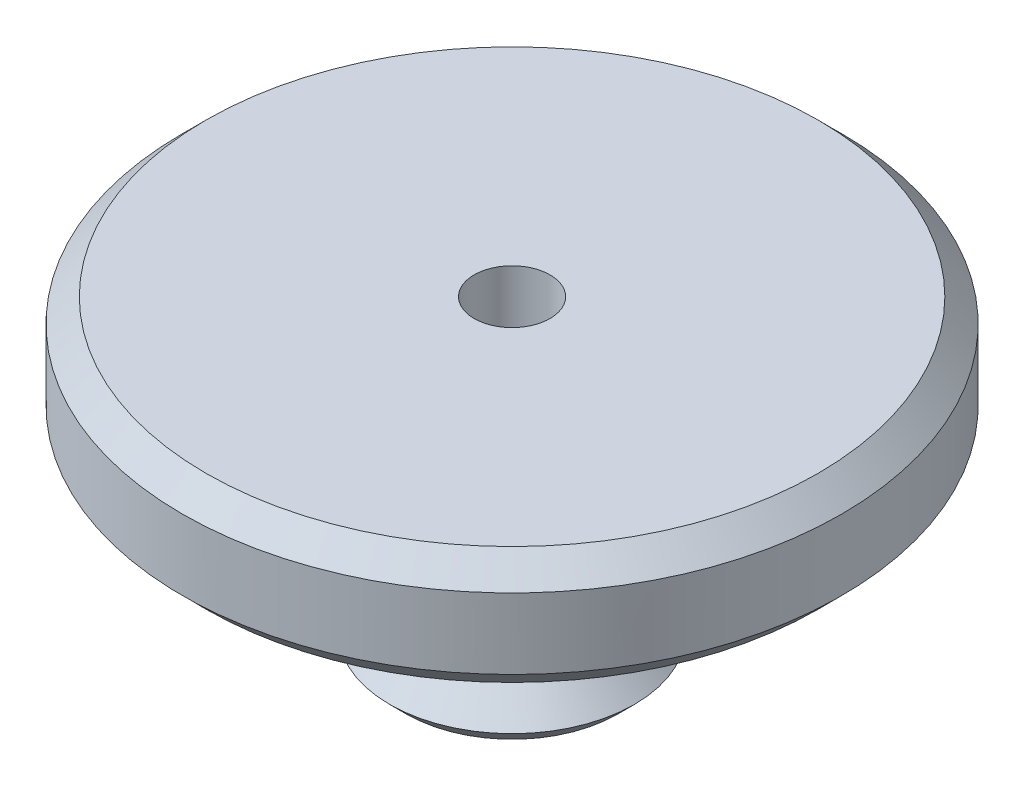
ISO-10303-21;
HEADER;
FILE_DESCRIPTION(('STEP AP214'),'2;1');
FILE_NAME('part.step','',(''),(''),'','','');
FILE_SCHEMA(('AUTOMOTIVE_DESIGN { 1 0 10303 214 1 1 1 1 }'));
ENDSEC;
DATA;
#1=APPLICATION_CONTEXT('core data for automotive mechanical design processes');
#2=APPLICATION_PROTOCOL_DEFINITION('international standard','automotive_design',2000,#1);
#3=PRODUCT_CONTEXT('',#1,'mechanical');
#4=PRODUCT('Part','Part','',(#3));
#5=PRODUCT_RELATED_PRODUCT_CATEGORY('part','',(#4));
#6=PRODUCT_DEFINITION_FORMATION('','',#4);
#7=PRODUCT_DEFINITION_CONTEXT('part definition',#1,'design');
#8=PRODUCT_DEFINITION('design','',#6,#7);
#9=PRODUCT_DEFINITION_SHAPE('','',#8);
#10=(LENGTH_UNIT() NAMED_UNIT(*) SI_UNIT(.MILLI.,.METRE.));
#11=(NAMED_UNIT(*) PLANE_ANGLE_UNIT() SI_UNIT($,.RADIAN.));
#12=(NAMED_UNIT(*) SI_UNIT($,.STERADIAN.) SOLID_ANGLE_UNIT());
#13=UNCERTAINTY_MEASURE_WITH_UNIT(LENGTH_MEASURE(1.E-05),#10,'distance_accuracy_value','');
#14=(GEOMETRIC_REPRESENTATION_CONTEXT(3) GLOBAL_UNCERTAINTY_ASSIGNED_CONTEXT((#13)) GLOBAL_UNIT_ASSIGNED_CONTEXT((#10,
#11,#12)) REPRESENTATION_CONTEXT('',''));
#15=CARTESIAN_POINT('',(0.,0.,0.));
#16=DIRECTION('',(0.,0.,1.));
#17=DIRECTION('',(1.,0.,0.));
#18=AXIS2_PLACEMENT_3D('',#15,#16,#17);
#19=CARTESIAN_POINT('',(0.,0.,0.));
#20=DIRECTION('',(0.,1.,0.));
#21=DIRECTION('',(0.,0.,1.));
#22=AXIS2_PLACEMENT_3D('',#19,#20,#21);
#23=PLANE('',#22);
#24=CARTESIAN_POINT('',(0.,0.,0.));
#25=DIRECTION('',(0.,1.,0.));
#26=DIRECTION('',(0.,0.,1.));
#27=AXIS2_PLACEMENT_3D('',#24,#25,#26);
#28=CIRCLE('',#27,13.);
#29=CARTESIAN_POINT('',(0.,0.,13.));
#30=VERTEX_POINT('',#29);
#31=EDGE_CURVE('E12',#30,#30,#28,.T.);
#32=ORIENTED_EDGE('',*,*,#31,.T.);
#33=EDGE_LOOP('',(#32));
#34=FACE_BOUND('',#33,.T.);
#35=CARTESIAN_POINT('',(0.,0.,0.));
#36=DIRECTION('',(0.,1.,0.));
#37=DIRECTION('',(0.,0.,1.));
#38=AXIS2_PLACEMENT_3D('',#35,#36,#37);
#39=CIRCLE('',#38,1.61);
#40=CARTESIAN_POINT('',(0.,0.,1.61));
#41=VERTEX_POINT('',#40);
#42=EDGE_CURVE('E98',#41,#41,#39,.T.);
#43=ORIENTED_EDGE('',*,*,#42,.F.);
#44=EDGE_LOOP('',(#43));
#45=FACE_BOUND('',#44,.T.);
#46=ADVANCED_FACE('F48',(#34,#45),#23,.T.);
#47=CARTESIAN_POINT('',(0.,-10.,0.));
#48=DIRECTION('',(0.,-1.,0.));
#49=DIRECTION('',(0.,0.,-1.));
#50=AXIS2_PLACEMENT_3D('',#47,#48,#49);
#51=CYLINDRICAL_SURFACE('',#50,14.);
#52=CARTESIAN_POINT('',(0.,-4.00000000000001,0.));
#53=DIRECTION('',(0.,-1.,0.));
#54=DIRECTION('',(0.,0.,-1.));
#55=AXIS2_PLACEMENT_3D('',#52,#53,#54);
#56=CIRCLE('',#55,14.);
#57=CARTESIAN_POINT('',(0.,-4.00000000000001,-14.));
#58=VERTEX_POINT('',#57);
#59=EDGE_CURVE('E55',#58,#58,#56,.F.);
#60=ORIENTED_EDGE('',*,*,#59,.T.);
#61=EDGE_LOOP('',(#60));
#62=FACE_BOUND('',#61,.T.);
#63=CARTESIAN_POINT('',(0.,-0.999999999999994,0.));
#64=DIRECTION('',(0.,1.,0.));
#65=DIRECTION('',(0.,0.,1.));
#66=AXIS2_PLACEMENT_3D('',#63,#64,#65);
#67=CIRCLE('',#66,14.);
#68=CARTESIAN_POINT('',(0.,-0.999999999999994,14.));
#69=VERTEX_POINT('',#68);
#70=EDGE_CURVE('E59',#69,#69,#67,.F.);
#71=ORIENTED_EDGE('',*,*,#70,.T.);
#72=EDGE_LOOP('',(#71));
#73=FACE_BOUND('',#72,.T.);
#74=ADVANCED_FACE('F105',(#62,#73),#51,.T.);
#75=CARTESIAN_POINT('',(14.,-5.,0.));
#76=DIRECTION('',(0.,-1.,0.));
#77=DIRECTION('',(0.,0.,-1.));
#78=AXIS2_PLACEMENT_3D('',#75,#76,#77);
#79=PLANE('',#78);
#80=CARTESIAN_POINT('',(0.,-5.,0.));
#81=DIRECTION('',(0.,-1.,0.));
#82=DIRECTION('',(0.,0.,-1.));
#83=AXIS2_PLACEMENT_3D('',#80,#81,#82);
#84=CIRCLE('',#83,13.);
#85=CARTESIAN_POINT('',(0.,-5.,-13.));
#86=VERTEX_POINT('',#85);
#87=EDGE_CURVE('E63',#86,#86,#84,.T.);
#88=ORIENTED_EDGE('',*,*,#87,.T.);
#89=EDGE_LOOP('',(#88));
#90=FACE_BOUND('',#89,.T.);
#91=CARTESIAN_POINT('',(0.,-5.,0.));
#92=DIRECTION('',(0.,-1.,0.));
#93=DIRECTION('',(0.,0.,-1.));
#94=AXIS2_PLACEMENT_3D('',#91,#92,#93);
#95=CIRCLE('',#94,5.);
#96=CARTESIAN_POINT('',(0.,-5.,-5.00000000000001));
#97=VERTEX_POINT('',#96);
#98=EDGE_CURVE('E74',#97,#97,#95,.T.);
#99=ORIENTED_EDGE('',*,*,#98,.F.);
#100=EDGE_LOOP('',(#99));
#101=FACE_BOUND('',#100,.T.);
#102=ADVANCED_FACE('F110',(#90,#101),#79,.T.);
#103=CARTESIAN_POINT('',(0.,-10.,0.));
#104=DIRECTION('',(0.,-1.,0.));
#105=DIRECTION('',(0.,0.,-1.));
#106=AXIS2_PLACEMENT_3D('',#103,#104,#105);
#107=CYLINDRICAL_SURFACE('',#106,5.);
#108=ORIENTED_EDGE('',*,*,#98,.T.);
#109=EDGE_LOOP('',(#108));
#110=FACE_BOUND('',#109,.T.);
#111=CARTESIAN_POINT('',(0.,-10.,0.));
#112=DIRECTION('',(0.,-1.,0.));
#113=DIRECTION('',(0.,0.,-1.));
#114=AXIS2_PLACEMENT_3D('',#111,#112,#113);
#115=CIRCLE('',#114,5.);
#116=CARTESIAN_POINT('',(0.,-10.,-5.00000000000001));
#117=VERTEX_POINT('',#116);
#118=EDGE_CURVE('E77',#117,#117,#115,.T.);
#119=ORIENTED_EDGE('',*,*,#118,.F.);
#120=EDGE_LOOP('',(#119));
#121=FACE_BOUND('',#120,.T.);
#122=ADVANCED_FACE('F129',(#110,#121),#107,.T.);
#123=CARTESIAN_POINT('',(5.00000000000001,-10.,0.));
#124=DIRECTION('',(0.,-1.,0.));
#125=DIRECTION('',(0.,0.,-1.));
#126=AXIS2_PLACEMENT_3D('',#123,#124,#125);
#127=PLANE('',#126);
#128=ORIENTED_EDGE('',*,*,#118,.T.);
#129=EDGE_LOOP('',(#128));
#130=FACE_BOUND('',#129,.T.);
#131=CARTESIAN_POINT('',(0.,-10.,0.));
#132=DIRECTION('',(0.,-1.,0.));
#133=DIRECTION('',(0.,0.,-1.));
#134=AXIS2_PLACEMENT_3D('',#131,#132,#133);
#135=CIRCLE('',#134,4.);
#136=CARTESIAN_POINT('',(0.,-10.,-4.00000000000001));
#137=VERTEX_POINT('',#136);
#138=EDGE_CURVE('E80',#137,#137,#135,.T.);
#139=ORIENTED_EDGE('',*,*,#138,.F.);
#140=EDGE_LOOP('',(#139));
#141=FACE_BOUND('',#140,.T.);
#142=ADVANCED_FACE('F134',(#130,#141),#127,.T.);
#143=CARTESIAN_POINT('',(0.,-10.,0.));
#144=DIRECTION('',(0.,-1.,0.));
#145=DIRECTION('',(0.,0.,-1.));
#146=AXIS2_PLACEMENT_3D('',#143,#144,#145);
#147=CYLINDRICAL_SURFACE('',#146,4.);
#148=ORIENTED_EDGE('',*,*,#138,.T.);
#149=EDGE_LOOP('',(#148));
#150=FACE_BOUND('',#149,.T.);
#151=CARTESIAN_POINT('',(0.,-11.2,0.));
#152=DIRECTION('',(0.,-1.,0.));
#153=DIRECTION('',(0.,0.,-1.));
#154=AXIS2_PLACEMENT_3D('',#151,#152,#153);
#155=CIRCLE('',#154,4.);
#156=CARTESIAN_POINT('',(0.,-11.2,-4.00000000000001));
#157=VERTEX_POINT('',#156);
#158=EDGE_CURVE('E83',#157,#157,#155,.T.);
#159=ORIENTED_EDGE('',*,*,#158,.F.);
#160=EDGE_LOOP('',(#159));
#161=FACE_BOUND('',#160,.T.);
#162=ADVANCED_FACE('F140',(#150,#161),#147,.T.);
#163=CARTESIAN_POINT('',(0.,-12.4,0.));
#164=DIRECTION('',(0.,-1.,0.));
#165=DIRECTION('',(0.,0.,-1.));
#166=AXIS2_PLACEMENT_3D('',#163,#164,#165);
#167=CONICAL_SURFACE('',#166,5.20000000000001,0.785398163397451);
#168=ORIENTED_EDGE('',*,*,#158,.T.);
#169=EDGE_LOOP('',(#168));
#170=FACE_BOUND('',#169,.T.);
#171=CARTESIAN_POINT('',(0.,-12.4,0.));
#172=DIRECTION('',(0.,-1.,0.));
#173=DIRECTION('',(0.,0.,-1.));
#174=AXIS2_PLACEMENT_3D('',#171,#172,#173);
#175=CIRCLE('',#174,5.20000000000001);
#176=CARTESIAN_POINT('',(0.,-12.4,-5.20000000000002));
#177=VERTEX_POINT('',#176);
#178=EDGE_CURVE('E86',#177,#177,#175,.T.);
#179=ORIENTED_EDGE('',*,*,#178,.F.);
#180=EDGE_LOOP('',(#179));
#181=FACE_BOUND('',#180,.T.);
#182=ADVANCED_FACE('F146',(#170,#181),#167,.T.);
#183=CARTESIAN_POINT('',(0.,-13.1071067811865,0.));
#184=DIRECTION('',(0.,1.,0.));
#185=DIRECTION('',(0.,0.,1.));
#186=AXIS2_PLACEMENT_3D('',#183,#184,#185);
#187=CONICAL_SURFACE('',#186,4.49289321881346,0.785398163397447);
#188=ORIENTED_EDGE('',*,*,#178,.T.);
#189=EDGE_LOOP('',(#188));
#190=FACE_BOUND('',#189,.T.);
#191=CARTESIAN_POINT('',(0.,-13.1071067811865,0.));
#192=DIRECTION('',(0.,-1.,0.));
#193=DIRECTION('',(0.,0.,-1.));
#194=AXIS2_PLACEMENT_3D('',#191,#192,#193);
#195=CIRCLE('',#194,4.49289321881346);
#196=CARTESIAN_POINT('',(0.,-13.1071067811865,-4.49289321881347));
#197=VERTEX_POINT('',#196);
#198=EDGE_CURVE('E89',#197,#197,#195,.T.);
#199=ORIENTED_EDGE('',*,*,#198,.F.);
#200=EDGE_LOOP('',(#199));
#201=FACE_BOUND('',#200,.T.);
#202=ADVANCED_FACE('F152',(#190,#201),#187,.T.);
#203=CARTESIAN_POINT('',(0.,-11.2,0.));
#204=DIRECTION('',(0.,-1.,0.));
#205=DIRECTION('',(0.,0.,-1.));
#206=AXIS2_PLACEMENT_3D('',#203,#204,#205);
#207=CONICAL_SURFACE('',#206,2.5857864376269,0.78539816339745);
#208=ORIENTED_EDGE('',*,*,#198,.T.);
#209=EDGE_LOOP('',(#208));
#210=FACE_BOUND('',#209,.T.);
#211=CARTESIAN_POINT('',(0.,-11.2,0.));
#212=DIRECTION('',(0.,-1.,0.));
#213=DIRECTION('',(0.,0.,-1.));
#214=AXIS2_PLACEMENT_3D('',#211,#212,#213);
#215=CIRCLE('',#214,2.5857864376269);
#216=CARTESIAN_POINT('',(0.,-11.2,-2.58578643762691));
#217=VERTEX_POINT('',#216);
#218=EDGE_CURVE('E92',#217,#217,#215,.T.);
#219=ORIENTED_EDGE('',*,*,#218,.F.);
#220=EDGE_LOOP('',(#219));
#221=FACE_BOUND('',#220,.T.);
#222=ADVANCED_FACE('F158',(#210,#221),#207,.F.);
#223=CARTESIAN_POINT('',(0.,-10.,0.));
#224=DIRECTION('',(0.,-1.,0.));
#225=DIRECTION('',(0.,0.,-1.));
#226=AXIS2_PLACEMENT_3D('',#223,#224,#225);
#227=CYLINDRICAL_SURFACE('',#226,2.5857864376269);
#228=ORIENTED_EDGE('',*,*,#218,.T.);
#229=EDGE_LOOP('',(#228));
#230=FACE_BOUND('',#229,.T.);
#231=CARTESIAN_POINT('',(0.,-10.,0.));
#232=DIRECTION('',(0.,-1.,0.));
#233=DIRECTION('',(0.,0.,-1.));
#234=AXIS2_PLACEMENT_3D('',#231,#232,#233);
#235=CIRCLE('',#234,2.5857864376269);
#236=CARTESIAN_POINT('',(0.,-10.,-2.58578643762691));
#237=VERTEX_POINT('',#236);
#238=EDGE_CURVE('E95',#237,#237,#235,.T.);
#239=ORIENTED_EDGE('',*,*,#238,.F.);
#240=EDGE_LOOP('',(#239));
#241=FACE_BOUND('',#240,.T.);
#242=ADVANCED_FACE('F164',(#230,#241),#227,.F.);
#243=CARTESIAN_POINT('',(2.58578643762691,-10.,0.));
#244=DIRECTION('',(0.,-1.,0.));
#245=DIRECTION('',(0.,0.,-1.));
#246=AXIS2_PLACEMENT_3D('',#243,#244,#245);
#247=PLANE('',#246);
#248=CARTESIAN_POINT('',(0.,-10.,0.));
#249=DIRECTION('',(0.,-1.,0.));
#250=DIRECTION('',(0.,0.,-1.));
#251=AXIS2_PLACEMENT_3D('',#248,#249,#250);
#252=CIRCLE('',#251,2.00000000000003);
#253=CARTESIAN_POINT('',(0.,-10.,-2.00000000000004));
#254=VERTEX_POINT('',#253);
#255=EDGE_CURVE('E68',#254,#254,#252,.F.);
#256=ORIENTED_EDGE('',*,*,#255,.T.);
#257=EDGE_LOOP('',(#256));
#258=FACE_BOUND('',#257,.T.);
#259=ORIENTED_EDGE('',*,*,#238,.T.);
#260=EDGE_LOOP('',(#259));
#261=FACE_BOUND('',#260,.T.);
#262=ADVANCED_FACE('F170',(#258,#261),#247,.T.);
#263=CARTESIAN_POINT('',(0.,-13.1071067811865,0.));
#264=DIRECTION('',(0.,1.,0.));
#265=DIRECTION('',(0.,0.,1.));
#266=AXIS2_PLACEMENT_3D('',#263,#264,#265);
#267=CYLINDRICAL_SURFACE('',#266,1.61);
#268=CARTESIAN_POINT('',(0.,-9.60999999999997,0.));
#269=DIRECTION('',(0.,-1.,0.));
#270=DIRECTION('',(0.,0.,-1.));
#271=AXIS2_PLACEMENT_3D('',#268,#269,#270);
#272=CIRCLE('',#271,1.61);
#273=CARTESIAN_POINT('',(0.,-9.60999999999997,-1.61));
#274=VERTEX_POINT('',#273);
#275=EDGE_CURVE('E71',#274,#274,#272,.T.);
#276=ORIENTED_EDGE('',*,*,#275,.T.);
#277=EDGE_LOOP('',(#276));
#278=FACE_BOUND('',#277,.T.);
#279=ORIENTED_EDGE('',*,*,#42,.T.);
#280=EDGE_LOOP('',(#279));
#281=FACE_BOUND('',#280,.T.);
#282=ADVANCED_FACE('F102',(#278,#281),#267,.F.);
#283=CARTESIAN_POINT('',(0.,-9.60999999999997,0.));
#284=DIRECTION('',(0.,-1.,0.));
#285=DIRECTION('',(0.,0.,-1.));
#286=AXIS2_PLACEMENT_3D('',#283,#284,#285);
#287=CONICAL_SURFACE('',#286,1.61,0.78539816339745);
#288=ORIENTED_EDGE('',*,*,#255,.F.);
#289=EDGE_LOOP('',(#288));
#290=FACE_BOUND('',#289,.T.);
#291=ORIENTED_EDGE('',*,*,#275,.F.);
#292=EDGE_LOOP('',(#291));
#293=FACE_BOUND('',#292,.T.);
#294=ADVANCED_FACE('F114',(#290,#293),#287,.F.);
#295=CARTESIAN_POINT('',(0.,-5.,0.));
#296=DIRECTION('',(0.,1.,0.));
#297=DIRECTION('',(0.,0.,1.));
#298=AXIS2_PLACEMENT_3D('',#295,#296,#297);
#299=CONICAL_SURFACE('',#298,13.,0.785398163397448);
#300=ORIENTED_EDGE('',*,*,#59,.F.);
#301=EDGE_LOOP('',(#300));
#302=FACE_BOUND('',#301,.T.);
#303=ORIENTED_EDGE('',*,*,#87,.F.);
#304=EDGE_LOOP('',(#303));
#305=FACE_BOUND('',#304,.T.);
#306=ADVANCED_FACE('F116',(#302,#305),#299,.T.);
#307=CARTESIAN_POINT('',(0.,-0.999999999999994,0.));
#308=DIRECTION('',(0.,-1.,0.));
#309=DIRECTION('',(0.,0.,-1.));
#310=AXIS2_PLACEMENT_3D('',#307,#308,#309);
#311=CONICAL_SURFACE('',#310,14.,0.78539816339745);
#312=ORIENTED_EDGE('',*,*,#31,.F.);
#313=EDGE_LOOP('',(#312));
#314=FACE_BOUND('',#313,.T.);
#315=ORIENTED_EDGE('',*,*,#70,.F.);
#316=EDGE_LOOP('',(#315));
#317=FACE_BOUND('',#316,.T.);
#318=ADVANCED_FACE('F50',(#314,#317),#311,.T.);
#319=CLOSED_SHELL('',(#46,#74,#102,#122,#142,#162,#182,#202,#222,#242,#262,#282,#294,#306,#318));
#320=MANIFOLD_SOLID_BREP('B2',#319);
#321=ADVANCED_BREP_SHAPE_REPRESENTATION('',(#18,#320),#14);
#322=SHAPE_DEFINITION_REPRESENTATION(#9,#321);
ENDSEC;
END-ISO-10303-21;
